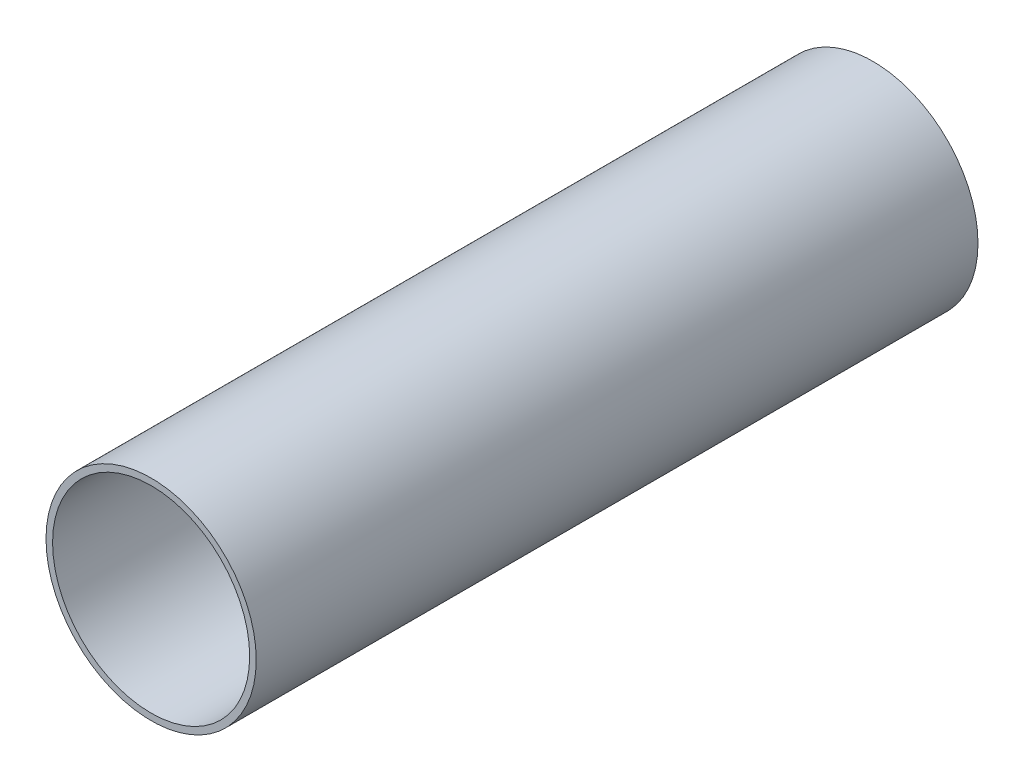
ISO-10303-21;
HEADER;
FILE_DESCRIPTION(('STEP AP214'),'2;1');
FILE_NAME('part.step','',(''),(''),'','','');
FILE_SCHEMA(('AUTOMOTIVE_DESIGN { 1 0 10303 214 1 1 1 1 }'));
ENDSEC;
DATA;
#1=APPLICATION_CONTEXT('core data for automotive mechanical design processes');
#2=APPLICATION_PROTOCOL_DEFINITION('international standard','automotive_design',2000,#1);
#3=PRODUCT_CONTEXT('',#1,'mechanical');
#4=PRODUCT('Part','Part','',(#3));
#5=PRODUCT_RELATED_PRODUCT_CATEGORY('part','',(#4));
#6=PRODUCT_DEFINITION_FORMATION('','',#4);
#7=PRODUCT_DEFINITION_CONTEXT('part definition',#1,'design');
#8=PRODUCT_DEFINITION('design','',#6,#7);
#9=PRODUCT_DEFINITION_SHAPE('','',#8);
#10=(LENGTH_UNIT() NAMED_UNIT(*) SI_UNIT(.MILLI.,.METRE.));
#11=(NAMED_UNIT(*) PLANE_ANGLE_UNIT() SI_UNIT($,.RADIAN.));
#12=(NAMED_UNIT(*) SI_UNIT($,.STERADIAN.) SOLID_ANGLE_UNIT());
#13=UNCERTAINTY_MEASURE_WITH_UNIT(LENGTH_MEASURE(1.E-05),#10,'distance_accuracy_value','');
#14=(GEOMETRIC_REPRESENTATION_CONTEXT(3) GLOBAL_UNCERTAINTY_ASSIGNED_CONTEXT((#13)) GLOBAL_UNIT_ASSIGNED_CONTEXT((#10,
#11,#12)) REPRESENTATION_CONTEXT('',''));
#15=CARTESIAN_POINT('',(0.,0.,0.));
#16=DIRECTION('',(0.,0.,1.));
#17=DIRECTION('',(1.,0.,0.));
#18=AXIS2_PLACEMENT_3D('',#15,#16,#17);
#19=CARTESIAN_POINT('',(0.,0.,2092.8));
#20=DIRECTION('',(0.,0.,1.));
#21=DIRECTION('',(1.,0.,0.));
#22=AXIS2_PLACEMENT_3D('',#19,#20,#21);
#23=PLANE('',#22);
#24=CARTESIAN_POINT('',(0.,0.,2092.8));
#25=DIRECTION('',(0.,0.,1.));
#26=DIRECTION('',(1.,0.,0.));
#27=AXIS2_PLACEMENT_3D('',#24,#25,#26);
#28=CIRCLE('',#27,304.8);
#29=CARTESIAN_POINT('',(304.8,0.,2092.8));
#30=VERTEX_POINT('',#29);
#31=EDGE_CURVE('E10',#30,#30,#28,.T.);
#32=ORIENTED_EDGE('',*,*,#31,.T.);
#33=EDGE_LOOP('',(#32));
#34=FACE_BOUND('',#33,.T.);
#35=CARTESIAN_POINT('',(0.,0.,2092.8));
#36=DIRECTION('',(0.,0.,1.));
#37=DIRECTION('',(1.,0.,0.));
#38=AXIS2_PLACEMENT_3D('',#35,#36,#37);
#39=CIRCLE('',#38,285.75);
#40=CARTESIAN_POINT('',(285.75,0.,2092.8));
#41=VERTEX_POINT('',#40);
#42=EDGE_CURVE('E40',#41,#41,#39,.T.);
#43=ORIENTED_EDGE('',*,*,#42,.F.);
#44=EDGE_LOOP('',(#43));
#45=FACE_BOUND('',#44,.T.);
#46=ADVANCED_FACE('F29',(#34,#45),#23,.T.);
#47=CARTESIAN_POINT('',(0.,0.,0.));
#48=DIRECTION('',(0.,0.,1.));
#49=DIRECTION('',(1.,0.,0.));
#50=AXIS2_PLACEMENT_3D('',#47,#48,#49);
#51=PLANE('',#50);
#52=CARTESIAN_POINT('',(0.,0.,0.));
#53=DIRECTION('',(0.,0.,1.));
#54=DIRECTION('',(1.,0.,0.));
#55=AXIS2_PLACEMENT_3D('',#52,#53,#54);
#56=CIRCLE('',#55,304.8);
#57=CARTESIAN_POINT('',(304.8,0.,0.));
#58=VERTEX_POINT('',#57);
#59=EDGE_CURVE('E33',#58,#58,#56,.T.);
#60=ORIENTED_EDGE('',*,*,#59,.F.);
#61=EDGE_LOOP('',(#60));
#62=FACE_BOUND('',#61,.T.);
#63=CARTESIAN_POINT('',(0.,0.,0.));
#64=DIRECTION('',(0.,0.,1.));
#65=DIRECTION('',(1.,0.,0.));
#66=AXIS2_PLACEMENT_3D('',#63,#64,#65);
#67=CIRCLE('',#66,285.75);
#68=CARTESIAN_POINT('',(285.75,0.,0.));
#69=VERTEX_POINT('',#68);
#70=EDGE_CURVE('E42',#69,#69,#67,.T.);
#71=ORIENTED_EDGE('',*,*,#70,.T.);
#72=EDGE_LOOP('',(#71));
#73=FACE_BOUND('',#72,.T.);
#74=ADVANCED_FACE('F52',(#62,#73),#51,.F.);
#75=CARTESIAN_POINT('',(0.,0.,2092.8));
#76=DIRECTION('',(0.,0.,-1.));
#77=DIRECTION('',(-1.,0.,0.));
#78=AXIS2_PLACEMENT_3D('',#75,#76,#77);
#79=CYLINDRICAL_SURFACE('',#78,304.8);
#80=ORIENTED_EDGE('',*,*,#31,.F.);
#81=EDGE_LOOP('',(#80));
#82=FACE_BOUND('',#81,.T.);
#83=ORIENTED_EDGE('',*,*,#59,.T.);
#84=EDGE_LOOP('',(#83));
#85=FACE_BOUND('',#84,.T.);
#86=ADVANCED_FACE('F31',(#82,#85),#79,.T.);
#87=CARTESIAN_POINT('',(0.,0.,2092.8));
#88=DIRECTION('',(0.,0.,-1.));
#89=DIRECTION('',(-1.,0.,0.));
#90=AXIS2_PLACEMENT_3D('',#87,#88,#89);
#91=CYLINDRICAL_SURFACE('',#90,285.75);
#92=ORIENTED_EDGE('',*,*,#42,.T.);
#93=EDGE_LOOP('',(#92));
#94=FACE_BOUND('',#93,.T.);
#95=ORIENTED_EDGE('',*,*,#70,.F.);
#96=EDGE_LOOP('',(#95));
#97=FACE_BOUND('',#96,.T.);
#98=ADVANCED_FACE('F48',(#94,#97),#91,.F.);
#99=CLOSED_SHELL('',(#46,#74,#86,#98));
#100=MANIFOLD_SOLID_BREP('B2',#99);
#101=ADVANCED_BREP_SHAPE_REPRESENTATION('',(#18,#100),#14);
#102=SHAPE_DEFINITION_REPRESENTATION(#9,#101);
ENDSEC;
END-ISO-10303-21;
